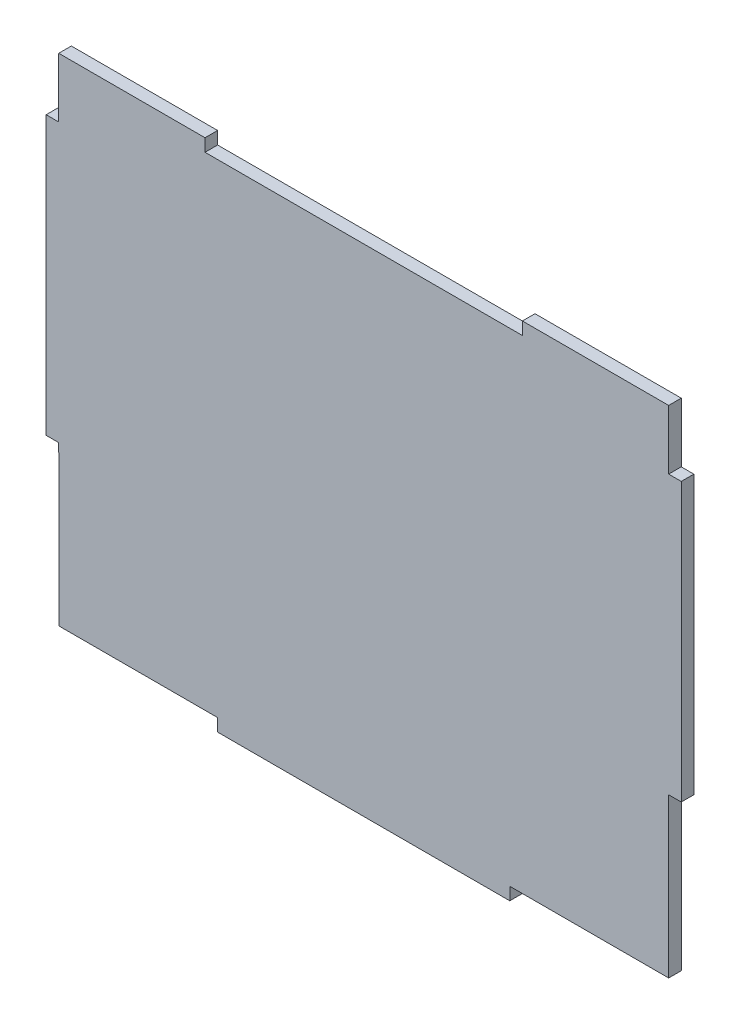
ISO-10303-21;
HEADER;
FILE_DESCRIPTION(('STEP AP214'),'2;1');
FILE_NAME('part.step','',(''),(''),'','','');
FILE_SCHEMA(('AUTOMOTIVE_DESIGN { 1 0 10303 214 1 1 1 1 }'));
ENDSEC;
DATA;
#1=APPLICATION_CONTEXT('core data for automotive mechanical design processes');
#2=APPLICATION_PROTOCOL_DEFINITION('international standard','automotive_design',2000,#1);
#3=PRODUCT_CONTEXT('',#1,'mechanical');
#4=PRODUCT('Part','Part','',(#3));
#5=PRODUCT_RELATED_PRODUCT_CATEGORY('part','',(#4));
#6=PRODUCT_DEFINITION_FORMATION('','',#4);
#7=PRODUCT_DEFINITION_CONTEXT('part definition',#1,'design');
#8=PRODUCT_DEFINITION('design','',#6,#7);
#9=PRODUCT_DEFINITION_SHAPE('','',#8);
#10=(LENGTH_UNIT() NAMED_UNIT(*) SI_UNIT(.MILLI.,.METRE.));
#11=(NAMED_UNIT(*) PLANE_ANGLE_UNIT() SI_UNIT($,.RADIAN.));
#12=(NAMED_UNIT(*) SI_UNIT($,.STERADIAN.) SOLID_ANGLE_UNIT());
#13=UNCERTAINTY_MEASURE_WITH_UNIT(LENGTH_MEASURE(1.E-05),#10,'distance_accuracy_value','');
#14=(GEOMETRIC_REPRESENTATION_CONTEXT(3) GLOBAL_UNCERTAINTY_ASSIGNED_CONTEXT((#13)) GLOBAL_UNIT_ASSIGNED_CONTEXT((#10,
#11,#12)) REPRESENTATION_CONTEXT('',''));
#15=CARTESIAN_POINT('',(0.,0.,0.));
#16=DIRECTION('',(0.,0.,1.));
#17=DIRECTION('',(1.,0.,0.));
#18=AXIS2_PLACEMENT_3D('',#15,#16,#17);
#19=CARTESIAN_POINT('',(-76.875,0.,3.175));
#20=DIRECTION('',(0.,-1.,0.));
#21=DIRECTION('',(0.,0.,-1.));
#22=AXIS2_PLACEMENT_3D('',#19,#20,#21);
#23=PLANE('',#22);
#24=DIRECTION('',(-1.,0.,0.));
#25=VECTOR('',#24,1.);
#26=CARTESIAN_POINT('',(-76.875,0.,0.));
#27=LINE('',#26,#25);
#28=CARTESIAN_POINT('',(76.875,0.,0.));
#29=VERTEX_POINT('',#28);
#30=CARTESIAN_POINT('',(40.,0.,0.));
#31=VERTEX_POINT('',#30);
#32=EDGE_CURVE('E210',#29,#31,#27,.T.);
#33=ORIENTED_EDGE('',*,*,#32,.T.);
#34=DIRECTION('',(0.,0.,1.));
#35=VECTOR('',#34,1.);
#36=CARTESIAN_POINT('',(40.,0.,0.));
#37=LINE('',#36,#35);
#38=CARTESIAN_POINT('',(40.,0.,3.175));
#39=VERTEX_POINT('',#38);
#40=EDGE_CURVE('E195',#31,#39,#37,.T.);
#41=ORIENTED_EDGE('',*,*,#40,.T.);
#42=DIRECTION('',(-1.,0.,0.));
#43=VECTOR('',#42,1.);
#44=CARTESIAN_POINT('',(-76.875,0.,3.175));
#45=LINE('',#44,#43);
#46=CARTESIAN_POINT('',(76.875,0.,3.175));
#47=VERTEX_POINT('',#46);
#48=EDGE_CURVE('E293',#47,#39,#45,.T.);
#49=ORIENTED_EDGE('',*,*,#48,.F.);
#50=DIRECTION('',(0.,0.,-1.));
#51=VECTOR('',#50,1.);
#52=CARTESIAN_POINT('',(76.875,0.,3.175));
#53=LINE('',#52,#51);
#54=EDGE_CURVE('E241',#47,#29,#53,.T.);
#55=ORIENTED_EDGE('',*,*,#54,.T.);
#56=EDGE_LOOP('',(#33,#41,#49,#55));
#57=FACE_BOUND('',#56,.T.);
#58=ADVANCED_FACE('F33',(#57),#23,.F.);
#59=CARTESIAN_POINT('',(-36.825,-128.174968749988,3.175));
#60=DIRECTION('',(0.,1.,0.));
#61=DIRECTION('',(0.,0.,1.));
#62=AXIS2_PLACEMENT_3D('',#59,#60,#61);
#63=PLANE('',#62);
#64=DIRECTION('',(1.,0.,0.));
#65=VECTOR('',#64,1.);
#66=CARTESIAN_POINT('',(-36.825,-128.174968749988,0.));
#67=LINE('',#66,#65);
#68=CARTESIAN_POINT('',(-36.825,-128.174968749988,0.));
#69=VERTEX_POINT('',#68);
#70=CARTESIAN_POINT('',(36.8250000000001,-128.174968749988,0.));
#71=VERTEX_POINT('',#70);
#72=EDGE_CURVE('E191',#69,#71,#67,.T.);
#73=ORIENTED_EDGE('',*,*,#72,.T.);
#74=DIRECTION('',(0.,0.,-1.));
#75=VECTOR('',#74,1.);
#76=CARTESIAN_POINT('',(36.8250000000001,-128.174968749988,3.175));
#77=LINE('',#76,#75);
#78=CARTESIAN_POINT('',(36.8250000000001,-128.174968749988,3.175));
#79=VERTEX_POINT('',#78);
#80=EDGE_CURVE('E11',#79,#71,#77,.T.);
#81=ORIENTED_EDGE('',*,*,#80,.F.);
#82=DIRECTION('',(1.,0.,0.));
#83=VECTOR('',#82,1.);
#84=CARTESIAN_POINT('',(-36.825,-128.174968749988,3.175));
#85=LINE('',#84,#83);
#86=CARTESIAN_POINT('',(-36.825,-128.174968749988,3.175));
#87=VERTEX_POINT('',#86);
#88=EDGE_CURVE('E225',#87,#79,#85,.T.);
#89=ORIENTED_EDGE('',*,*,#88,.F.);
#90=DIRECTION('',(0.,0.,-1.));
#91=VECTOR('',#90,1.);
#92=CARTESIAN_POINT('',(-36.825,-128.174968749988,3.175));
#93=LINE('',#92,#91);
#94=EDGE_CURVE('E187',#87,#69,#93,.T.);
#95=ORIENTED_EDGE('',*,*,#94,.T.);
#96=EDGE_LOOP('',(#73,#81,#89,#95));
#97=FACE_BOUND('',#96,.T.);
#98=ADVANCED_FACE('F35',(#97),#63,.F.);
#99=CARTESIAN_POINT('',(36.8250000000001,-128.174968749988,3.175));
#100=DIRECTION('',(-1.,0.,0.));
#101=DIRECTION('',(0.,-1.,0.));
#102=AXIS2_PLACEMENT_3D('',#99,#100,#101);
#103=PLANE('',#102);
#104=DIRECTION('',(0.,1.,0.));
#105=VECTOR('',#104,1.);
#106=CARTESIAN_POINT('',(36.8250000000001,-128.174968749988,0.));
#107=LINE('',#106,#105);
#108=CARTESIAN_POINT('',(36.8250000000001,-124.999968749988,0.));
#109=VERTEX_POINT('',#108);
#110=EDGE_CURVE('E194',#71,#109,#107,.T.);
#111=ORIENTED_EDGE('',*,*,#110,.T.);
#112=DIRECTION('',(0.,0.,-1.));
#113=VECTOR('',#112,1.);
#114=CARTESIAN_POINT('',(36.8250000000001,-124.999968749988,3.175));
#115=LINE('',#114,#113);
#116=CARTESIAN_POINT('',(36.8250000000001,-124.999968749988,3.175));
#117=VERTEX_POINT('',#116);
#118=EDGE_CURVE('E41',#117,#109,#115,.T.);
#119=ORIENTED_EDGE('',*,*,#118,.F.);
#120=DIRECTION('',(0.,1.,0.));
#121=VECTOR('',#120,1.);
#122=CARTESIAN_POINT('',(36.8250000000001,-128.174968749988,3.175));
#123=LINE('',#122,#121);
#124=EDGE_CURVE('E122',#79,#117,#123,.T.);
#125=ORIENTED_EDGE('',*,*,#124,.F.);
#126=ORIENTED_EDGE('',*,*,#80,.T.);
#127=EDGE_LOOP('',(#111,#119,#125,#126));
#128=FACE_BOUND('',#127,.T.);
#129=ADVANCED_FACE('F401',(#128),#103,.F.);
#130=CARTESIAN_POINT('',(36.8250000000001,-124.999968749988,3.175));
#131=DIRECTION('',(0.,1.,0.));
#132=DIRECTION('',(-1.,0.,0.));
#133=AXIS2_PLACEMENT_3D('',#130,#131,#132);
#134=PLANE('',#133);
#135=DIRECTION('',(1.,0.,0.));
#136=VECTOR('',#135,1.);
#137=CARTESIAN_POINT('',(36.8250000000001,-124.999968749988,0.));
#138=LINE('',#137,#136);
#139=CARTESIAN_POINT('',(76.875,-124.999968749988,0.));
#140=VERTEX_POINT('',#139);
#141=EDGE_CURVE('E197',#109,#140,#138,.T.);
#142=ORIENTED_EDGE('',*,*,#141,.T.);
#143=DIRECTION('',(0.,0.,-1.));
#144=VECTOR('',#143,1.);
#145=CARTESIAN_POINT('',(76.875,-124.999968749988,3.175));
#146=LINE('',#145,#144);
#147=CARTESIAN_POINT('',(76.875,-124.999968749988,3.175));
#148=VERTEX_POINT('',#147);
#149=EDGE_CURVE('E256',#148,#140,#146,.T.);
#150=ORIENTED_EDGE('',*,*,#149,.F.);
#151=DIRECTION('',(1.,0.,0.));
#152=VECTOR('',#151,1.);
#153=CARTESIAN_POINT('',(36.8250000000001,-124.999968749988,3.175));
#154=LINE('',#153,#152);
#155=EDGE_CURVE('E264',#117,#148,#154,.T.);
#156=ORIENTED_EDGE('',*,*,#155,.F.);
#157=ORIENTED_EDGE('',*,*,#118,.T.);
#158=EDGE_LOOP('',(#142,#150,#156,#157));
#159=FACE_BOUND('',#158,.T.);
#160=ADVANCED_FACE('F262',(#159),#134,.F.);
#161=CARTESIAN_POINT('',(76.875,-85.,3.175));
#162=DIRECTION('',(-1.,0.,0.));
#163=DIRECTION('',(0.,-1.,0.));
#164=AXIS2_PLACEMENT_3D('',#161,#162,#163);
#165=PLANE('',#164);
#166=DIRECTION('',(0.,1.,0.));
#167=VECTOR('',#166,1.);
#168=CARTESIAN_POINT('',(76.875,-85.,0.));
#169=LINE('',#168,#167);
#170=CARTESIAN_POINT('',(76.875,-85.,0.));
#171=VERTEX_POINT('',#170);
#172=EDGE_CURVE('E199',#140,#171,#169,.T.);
#173=ORIENTED_EDGE('',*,*,#172,.T.);
#174=DIRECTION('',(0.,0.,-1.));
#175=VECTOR('',#174,1.);
#176=CARTESIAN_POINT('',(76.875,-85.,3.175));
#177=LINE('',#176,#175);
#178=CARTESIAN_POINT('',(76.875,-85.,3.175));
#179=VERTEX_POINT('',#178);
#180=EDGE_CURVE('E253',#179,#171,#177,.T.);
#181=ORIENTED_EDGE('',*,*,#180,.F.);
#182=DIRECTION('',(0.,1.,0.));
#183=VECTOR('',#182,1.);
#184=CARTESIAN_POINT('',(76.875,-85.,3.175));
#185=LINE('',#184,#183);
#186=EDGE_CURVE('E282',#148,#179,#185,.T.);
#187=ORIENTED_EDGE('',*,*,#186,.F.);
#188=ORIENTED_EDGE('',*,*,#149,.T.);
#189=EDGE_LOOP('',(#173,#181,#187,#188));
#190=FACE_BOUND('',#189,.T.);
#191=ADVANCED_FACE('F273',(#190),#165,.F.);
#192=CARTESIAN_POINT('',(80.05,-85.,3.175));
#193=DIRECTION('',(0.,1.,0.));
#194=DIRECTION('',(-1.,0.,0.));
#195=AXIS2_PLACEMENT_3D('',#192,#193,#194);
#196=PLANE('',#195);
#197=DIRECTION('',(1.,0.,0.));
#198=VECTOR('',#197,1.);
#199=CARTESIAN_POINT('',(80.05,-85.,0.));
#200=LINE('',#199,#198);
#201=CARTESIAN_POINT('',(80.05,-85.,0.));
#202=VERTEX_POINT('',#201);
#203=EDGE_CURVE('E201',#171,#202,#200,.T.);
#204=ORIENTED_EDGE('',*,*,#203,.T.);
#205=DIRECTION('',(0.,0.,-1.));
#206=VECTOR('',#205,1.);
#207=CARTESIAN_POINT('',(80.05,-85.,3.175));
#208=LINE('',#207,#206);
#209=CARTESIAN_POINT('',(80.05,-85.,3.175));
#210=VERTEX_POINT('',#209);
#211=EDGE_CURVE('E250',#210,#202,#208,.T.);
#212=ORIENTED_EDGE('',*,*,#211,.F.);
#213=DIRECTION('',(1.,0.,0.));
#214=VECTOR('',#213,1.);
#215=CARTESIAN_POINT('',(80.05,-85.,3.175));
#216=LINE('',#215,#214);
#217=EDGE_CURVE('E279',#179,#210,#216,.T.);
#218=ORIENTED_EDGE('',*,*,#217,.F.);
#219=ORIENTED_EDGE('',*,*,#180,.T.);
#220=EDGE_LOOP('',(#204,#212,#218,#219));
#221=FACE_BOUND('',#220,.T.);
#222=ADVANCED_FACE('F277',(#221),#196,.F.);
#223=CARTESIAN_POINT('',(80.05,-15.,3.175));
#224=DIRECTION('',(-1.,0.,0.));
#225=DIRECTION('',(0.,-1.,0.));
#226=AXIS2_PLACEMENT_3D('',#223,#224,#225);
#227=PLANE('',#226);
#228=DIRECTION('',(0.,1.,0.));
#229=VECTOR('',#228,1.);
#230=CARTESIAN_POINT('',(80.05,-15.,0.));
#231=LINE('',#230,#229);
#232=CARTESIAN_POINT('',(80.05,-15.,0.));
#233=VERTEX_POINT('',#232);
#234=EDGE_CURVE('E203',#202,#233,#231,.T.);
#235=ORIENTED_EDGE('',*,*,#234,.T.);
#236=DIRECTION('',(0.,0.,-1.));
#237=VECTOR('',#236,1.);
#238=CARTESIAN_POINT('',(80.05,-15.,3.175));
#239=LINE('',#238,#237);
#240=CARTESIAN_POINT('',(80.05,-15.,3.175));
#241=VERTEX_POINT('',#240);
#242=EDGE_CURVE('E247',#241,#233,#239,.T.);
#243=ORIENTED_EDGE('',*,*,#242,.F.);
#244=DIRECTION('',(0.,1.,0.));
#245=VECTOR('',#244,1.);
#246=CARTESIAN_POINT('',(80.05,-15.,3.175));
#247=LINE('',#246,#245);
#248=EDGE_CURVE('E281',#210,#241,#247,.T.);
#249=ORIENTED_EDGE('',*,*,#248,.F.);
#250=ORIENTED_EDGE('',*,*,#211,.T.);
#251=EDGE_LOOP('',(#235,#243,#249,#250));
#252=FACE_BOUND('',#251,.T.);
#253=ADVANCED_FACE('F387',(#252),#227,.F.);
#254=CARTESIAN_POINT('',(76.875,-15.,3.175));
#255=DIRECTION('',(0.,-1.,0.));
#256=DIRECTION('',(0.,0.,-1.));
#257=AXIS2_PLACEMENT_3D('',#254,#255,#256);
#258=PLANE('',#257);
#259=DIRECTION('',(-1.,0.,0.));
#260=VECTOR('',#259,1.);
#261=CARTESIAN_POINT('',(76.875,-15.,0.));
#262=LINE('',#261,#260);
#263=CARTESIAN_POINT('',(76.875,-15.,0.));
#264=VERTEX_POINT('',#263);
#265=EDGE_CURVE('E205',#233,#264,#262,.T.);
#266=ORIENTED_EDGE('',*,*,#265,.T.);
#267=DIRECTION('',(0.,0.,-1.));
#268=VECTOR('',#267,1.);
#269=CARTESIAN_POINT('',(76.875,-15.,3.175));
#270=LINE('',#269,#268);
#271=CARTESIAN_POINT('',(76.875,-15.,3.175));
#272=VERTEX_POINT('',#271);
#273=EDGE_CURVE('E244',#272,#264,#270,.T.);
#274=ORIENTED_EDGE('',*,*,#273,.F.);
#275=DIRECTION('',(-1.,0.,0.));
#276=VECTOR('',#275,1.);
#277=CARTESIAN_POINT('',(76.875,-15.,3.175));
#278=LINE('',#277,#276);
#279=EDGE_CURVE('E284',#241,#272,#278,.T.);
#280=ORIENTED_EDGE('',*,*,#279,.F.);
#281=ORIENTED_EDGE('',*,*,#242,.T.);
#282=EDGE_LOOP('',(#266,#274,#280,#281));
#283=FACE_BOUND('',#282,.T.);
#284=ADVANCED_FACE('F383',(#283),#258,.F.);
#285=CARTESIAN_POINT('',(76.875,0.,3.175));
#286=DIRECTION('',(-1.,0.,0.));
#287=DIRECTION('',(0.,0.,1.));
#288=AXIS2_PLACEMENT_3D('',#285,#286,#287);
#289=PLANE('',#288);
#290=DIRECTION('',(0.,1.,0.));
#291=VECTOR('',#290,1.);
#292=CARTESIAN_POINT('',(76.875,0.,0.));
#293=LINE('',#292,#291);
#294=EDGE_CURVE('E207',#264,#29,#293,.T.);
#295=ORIENTED_EDGE('',*,*,#294,.T.);
#296=ORIENTED_EDGE('',*,*,#54,.F.);
#297=DIRECTION('',(0.,1.,0.));
#298=VECTOR('',#297,1.);
#299=CARTESIAN_POINT('',(76.875,0.,3.175));
#300=LINE('',#299,#298);
#301=EDGE_CURVE('E290',#272,#47,#300,.T.);
#302=ORIENTED_EDGE('',*,*,#301,.F.);
#303=ORIENTED_EDGE('',*,*,#273,.T.);
#304=EDGE_LOOP('',(#295,#296,#302,#303));
#305=FACE_BOUND('',#304,.T.);
#306=ADVANCED_FACE('F379',(#305),#289,.F.);
#307=CARTESIAN_POINT('',(-40.,0.,3.175));
#308=VERTEX_POINT('',#307);
#309=CARTESIAN_POINT('',(-76.875,0.,3.175));
#310=VERTEX_POINT('',#309);
#311=EDGE_CURVE('E292',#308,#310,#45,.T.);
#312=ORIENTED_EDGE('',*,*,#311,.F.);
#313=DIRECTION('',(0.,0.,1.));
#314=VECTOR('',#313,1.);
#315=CARTESIAN_POINT('',(-40.,0.,0.));
#316=LINE('',#315,#314);
#317=CARTESIAN_POINT('',(-40.,0.,0.));
#318=VERTEX_POINT('',#317);
#319=EDGE_CURVE('E318',#318,#308,#316,.T.);
#320=ORIENTED_EDGE('',*,*,#319,.F.);
#321=CARTESIAN_POINT('',(-76.875,0.,0.));
#322=VERTEX_POINT('',#321);
#323=EDGE_CURVE('E209',#318,#322,#27,.T.);
#324=ORIENTED_EDGE('',*,*,#323,.T.);
#325=DIRECTION('',(0.,0.,-1.));
#326=VECTOR('',#325,1.);
#327=CARTESIAN_POINT('',(-76.875,0.,3.175));
#328=LINE('',#327,#326);
#329=EDGE_CURVE('E238',#310,#322,#328,.T.);
#330=ORIENTED_EDGE('',*,*,#329,.F.);
#331=EDGE_LOOP('',(#312,#320,#324,#330));
#332=FACE_BOUND('',#331,.T.);
#333=ADVANCED_FACE('F356',(#332),#23,.F.);
#334=CARTESIAN_POINT('',(-76.875,0.,3.175));
#335=DIRECTION('',(1.,0.,0.));
#336=DIRECTION('',(0.,0.,-1.));
#337=AXIS2_PLACEMENT_3D('',#334,#335,#336);
#338=PLANE('',#337);
#339=DIRECTION('',(0.,-1.,0.));
#340=VECTOR('',#339,1.);
#341=CARTESIAN_POINT('',(-76.875,0.,0.));
#342=LINE('',#341,#340);
#343=CARTESIAN_POINT('',(-76.875,-15.,0.));
#344=VERTEX_POINT('',#343);
#345=EDGE_CURVE('E213',#322,#344,#342,.T.);
#346=ORIENTED_EDGE('',*,*,#345,.T.);
#347=DIRECTION('',(0.,0.,-1.));
#348=VECTOR('',#347,1.);
#349=CARTESIAN_POINT('',(-76.875,-15.,3.175));
#350=LINE('',#349,#348);
#351=CARTESIAN_POINT('',(-76.875,-15.,3.175));
#352=VERTEX_POINT('',#351);
#353=EDGE_CURVE('E235',#352,#344,#350,.T.);
#354=ORIENTED_EDGE('',*,*,#353,.F.);
#355=DIRECTION('',(0.,-1.,0.));
#356=VECTOR('',#355,1.);
#357=CARTESIAN_POINT('',(-76.875,0.,3.175));
#358=LINE('',#357,#356);
#359=EDGE_CURVE('E296',#310,#352,#358,.T.);
#360=ORIENTED_EDGE('',*,*,#359,.F.);
#361=ORIENTED_EDGE('',*,*,#329,.T.);
#362=EDGE_LOOP('',(#346,#354,#360,#361));
#363=FACE_BOUND('',#362,.T.);
#364=ADVANCED_FACE('F405',(#363),#338,.F.);
#365=CARTESIAN_POINT('',(-76.875,-15.,3.175));
#366=DIRECTION('',(0.,-1.,0.));
#367=DIRECTION('',(1.,0.,0.));
#368=AXIS2_PLACEMENT_3D('',#365,#366,#367);
#369=PLANE('',#368);
#370=DIRECTION('',(-1.,0.,0.));
#371=VECTOR('',#370,1.);
#372=CARTESIAN_POINT('',(-76.875,-15.,0.));
#373=LINE('',#372,#371);
#374=CARTESIAN_POINT('',(-80.05,-15.,0.));
#375=VERTEX_POINT('',#374);
#376=EDGE_CURVE('E215',#344,#375,#373,.T.);
#377=ORIENTED_EDGE('',*,*,#376,.T.);
#378=DIRECTION('',(0.,0.,-1.));
#379=VECTOR('',#378,1.);
#380=CARTESIAN_POINT('',(-80.05,-15.,3.175));
#381=LINE('',#380,#379);
#382=CARTESIAN_POINT('',(-80.05,-15.,3.175));
#383=VERTEX_POINT('',#382);
#384=EDGE_CURVE('E232',#383,#375,#381,.T.);
#385=ORIENTED_EDGE('',*,*,#384,.F.);
#386=DIRECTION('',(-1.,0.,0.));
#387=VECTOR('',#386,1.);
#388=CARTESIAN_POINT('',(-76.875,-15.,3.175));
#389=LINE('',#388,#387);
#390=EDGE_CURVE('E298',#352,#383,#389,.T.);
#391=ORIENTED_EDGE('',*,*,#390,.F.);
#392=ORIENTED_EDGE('',*,*,#353,.T.);
#393=EDGE_LOOP('',(#377,#385,#391,#392));
#394=FACE_BOUND('',#393,.T.);
#395=ADVANCED_FACE('F410',(#394),#369,.F.);
#396=CARTESIAN_POINT('',(-80.05,-15.,3.175));
#397=DIRECTION('',(1.,0.,0.));
#398=DIRECTION('',(0.,1.,0.));
#399=AXIS2_PLACEMENT_3D('',#396,#397,#398);
#400=PLANE('',#399);
#401=DIRECTION('',(0.,-1.,0.));
#402=VECTOR('',#401,1.);
#403=CARTESIAN_POINT('',(-80.05,-15.,0.));
#404=LINE('',#403,#402);
#405=CARTESIAN_POINT('',(-80.05,-85.,0.));
#406=VERTEX_POINT('',#405);
#407=EDGE_CURVE('E217',#375,#406,#404,.T.);
#408=ORIENTED_EDGE('',*,*,#407,.T.);
#409=DIRECTION('',(0.,0.,-1.));
#410=VECTOR('',#409,1.);
#411=CARTESIAN_POINT('',(-80.05,-85.,3.175));
#412=LINE('',#411,#410);
#413=CARTESIAN_POINT('',(-80.05,-85.,3.175));
#414=VERTEX_POINT('',#413);
#415=EDGE_CURVE('E229',#414,#406,#412,.T.);
#416=ORIENTED_EDGE('',*,*,#415,.F.);
#417=DIRECTION('',(0.,-1.,0.));
#418=VECTOR('',#417,1.);
#419=CARTESIAN_POINT('',(-80.05,-15.,3.175));
#420=LINE('',#419,#418);
#421=EDGE_CURVE('E300',#383,#414,#420,.T.);
#422=ORIENTED_EDGE('',*,*,#421,.F.);
#423=ORIENTED_EDGE('',*,*,#384,.T.);
#424=EDGE_LOOP('',(#408,#416,#422,#423));
#425=FACE_BOUND('',#424,.T.);
#426=ADVANCED_FACE('F306',(#425),#400,.F.);
#427=CARTESIAN_POINT('',(-80.05,-85.,3.175));
#428=DIRECTION('',(0.,1.,0.));
#429=DIRECTION('',(-1.,0.,0.));
#430=AXIS2_PLACEMENT_3D('',#427,#428,#429);
#431=PLANE('',#430);
#432=DIRECTION('',(1.,0.,0.));
#433=VECTOR('',#432,1.);
#434=CARTESIAN_POINT('',(-80.05,-85.,0.));
#435=LINE('',#434,#433);
#436=CARTESIAN_POINT('',(-76.875,-85.,0.));
#437=VERTEX_POINT('',#436);
#438=EDGE_CURVE('E219',#406,#437,#435,.T.);
#439=ORIENTED_EDGE('',*,*,#438,.T.);
#440=DIRECTION('',(0.,0.,-1.));
#441=VECTOR('',#440,1.);
#442=CARTESIAN_POINT('',(-76.875,-85.,3.175));
#443=LINE('',#442,#441);
#444=CARTESIAN_POINT('',(-76.875,-85.,3.175));
#445=VERTEX_POINT('',#444);
#446=EDGE_CURVE('E182',#445,#437,#443,.T.);
#447=ORIENTED_EDGE('',*,*,#446,.F.);
#448=DIRECTION('',(1.,0.,0.));
#449=VECTOR('',#448,1.);
#450=CARTESIAN_POINT('',(-80.05,-85.,3.175));
#451=LINE('',#450,#449);
#452=EDGE_CURVE('E170',#414,#445,#451,.T.);
#453=ORIENTED_EDGE('',*,*,#452,.F.);
#454=ORIENTED_EDGE('',*,*,#415,.T.);
#455=EDGE_LOOP('',(#439,#447,#453,#454));
#456=FACE_BOUND('',#455,.T.);
#457=ADVANCED_FACE('F310',(#456),#431,.F.);
#458=CARTESIAN_POINT('',(-76.875,-85.,3.175));
#459=DIRECTION('',(0.999999218749695,0.00124999999999848,0.));
#460=DIRECTION('',(-0.00124999999999848,0.999999218749695,0.));
#461=AXIS2_PLACEMENT_3D('',#458,#459,#460);
#462=PLANE('',#461);
#463=DIRECTION('',(0.00124999999999847,-0.999999218749695,0.));
#464=VECTOR('',#463,1.);
#465=CARTESIAN_POINT('',(-76.875,-85.,0.));
#466=LINE('',#465,#464);
#467=CARTESIAN_POINT('',(-76.825,-124.999968749988,0.));
#468=VERTEX_POINT('',#467);
#469=EDGE_CURVE('E179',#437,#468,#466,.T.);
#470=ORIENTED_EDGE('',*,*,#469,.T.);
#471=DIRECTION('',(0.,0.,-1.));
#472=VECTOR('',#471,1.);
#473=CARTESIAN_POINT('',(-76.825,-124.999968749988,3.175));
#474=LINE('',#473,#472);
#475=CARTESIAN_POINT('',(-76.825,-124.999968749988,3.175));
#476=VERTEX_POINT('',#475);
#477=EDGE_CURVE('E176',#476,#468,#474,.T.);
#478=ORIENTED_EDGE('',*,*,#477,.F.);
#479=DIRECTION('',(0.00124999999999847,-0.999999218749695,0.));
#480=VECTOR('',#479,1.);
#481=CARTESIAN_POINT('',(-76.875,-85.,3.175));
#482=LINE('',#481,#480);
#483=EDGE_CURVE('E162',#445,#476,#482,.T.);
#484=ORIENTED_EDGE('',*,*,#483,.F.);
#485=ORIENTED_EDGE('',*,*,#446,.T.);
#486=EDGE_LOOP('',(#470,#478,#484,#485));
#487=FACE_BOUND('',#486,.T.);
#488=ADVANCED_FACE('F177',(#487),#462,.F.);
#489=CARTESIAN_POINT('',(-76.825,-124.999968749988,3.175));
#490=DIRECTION('',(0.,1.,0.));
#491=DIRECTION('',(0.,0.,1.));
#492=AXIS2_PLACEMENT_3D('',#489,#490,#491);
#493=PLANE('',#492);
#494=DIRECTION('',(1.,0.,0.));
#495=VECTOR('',#494,1.);
#496=CARTESIAN_POINT('',(-76.825,-124.999968749988,0.));
#497=LINE('',#496,#495);
#498=CARTESIAN_POINT('',(-36.825,-124.999968749988,0.));
#499=VERTEX_POINT('',#498);
#500=EDGE_CURVE('E222',#468,#499,#497,.T.);
#501=ORIENTED_EDGE('',*,*,#500,.T.);
#502=DIRECTION('',(0.,0.,-1.));
#503=VECTOR('',#502,1.);
#504=CARTESIAN_POINT('',(-36.825,-124.999968749988,3.175));
#505=LINE('',#504,#503);
#506=CARTESIAN_POINT('',(-36.825,-124.999968749988,3.175));
#507=VERTEX_POINT('',#506);
#508=EDGE_CURVE('E183',#507,#499,#505,.T.);
#509=ORIENTED_EDGE('',*,*,#508,.F.);
#510=DIRECTION('',(1.,0.,0.));
#511=VECTOR('',#510,1.);
#512=CARTESIAN_POINT('',(-76.825,-124.999968749988,3.175));
#513=LINE('',#512,#511);
#514=EDGE_CURVE('E167',#476,#507,#513,.T.);
#515=ORIENTED_EDGE('',*,*,#514,.F.);
#516=ORIENTED_EDGE('',*,*,#477,.T.);
#517=EDGE_LOOP('',(#501,#509,#515,#516));
#518=FACE_BOUND('',#517,.T.);
#519=ADVANCED_FACE('F185',(#518),#493,.F.);
#520=CARTESIAN_POINT('',(-36.825,-128.174968749988,3.175));
#521=DIRECTION('',(1.,0.,0.));
#522=DIRECTION('',(0.,1.,0.));
#523=AXIS2_PLACEMENT_3D('',#520,#521,#522);
#524=PLANE('',#523);
#525=DIRECTION('',(0.,-1.,0.));
#526=VECTOR('',#525,1.);
#527=CARTESIAN_POINT('',(-36.825,-128.174968749988,0.));
#528=LINE('',#527,#526);
#529=EDGE_CURVE('E114',#499,#69,#528,.T.);
#530=ORIENTED_EDGE('',*,*,#529,.T.);
#531=ORIENTED_EDGE('',*,*,#94,.F.);
#532=DIRECTION('',(0.,-1.,0.));
#533=VECTOR('',#532,1.);
#534=CARTESIAN_POINT('',(-36.825,-128.174968749988,3.175));
#535=LINE('',#534,#533);
#536=EDGE_CURVE('E57',#507,#87,#535,.T.);
#537=ORIENTED_EDGE('',*,*,#536,.F.);
#538=ORIENTED_EDGE('',*,*,#508,.T.);
#539=EDGE_LOOP('',(#530,#531,#537,#538));
#540=FACE_BOUND('',#539,.T.);
#541=ADVANCED_FACE('F311',(#540),#524,.F.);
#542=CARTESIAN_POINT('',(0.,0.,3.175));
#543=DIRECTION('',(0.,0.,1.));
#544=DIRECTION('',(1.,0.,0.));
#545=AXIS2_PLACEMENT_3D('',#542,#543,#544);
#546=PLANE('',#545);
#547=DIRECTION('',(0.,1.,0.));
#548=VECTOR('',#547,1.);
#549=CARTESIAN_POINT('',(40.,0.,3.175));
#550=LINE('',#549,#548);
#551=CARTESIAN_POINT('',(40.,-3.17499999999999,3.175));
#552=VERTEX_POINT('',#551);
#553=EDGE_CURVE('E329',#552,#39,#550,.T.);
#554=ORIENTED_EDGE('',*,*,#553,.F.);
#555=DIRECTION('',(1.,0.,0.));
#556=VECTOR('',#555,1.);
#557=CARTESIAN_POINT('',(40.,-3.17499999999999,3.175));
#558=LINE('',#557,#556);
#559=CARTESIAN_POINT('',(-40.,-3.17500000000001,3.175));
#560=VERTEX_POINT('',#559);
#561=EDGE_CURVE('E333',#560,#552,#558,.T.);
#562=ORIENTED_EDGE('',*,*,#561,.F.);
#563=DIRECTION('',(0.,-1.,0.));
#564=VECTOR('',#563,1.);
#565=CARTESIAN_POINT('',(-40.,-3.17500000000001,3.175));
#566=LINE('',#565,#564);
#567=EDGE_CURVE('E336',#308,#560,#566,.T.);
#568=ORIENTED_EDGE('',*,*,#567,.F.);
#569=ORIENTED_EDGE('',*,*,#311,.T.);
#570=ORIENTED_EDGE('',*,*,#359,.T.);
#571=ORIENTED_EDGE('',*,*,#390,.T.);
#572=ORIENTED_EDGE('',*,*,#421,.T.);
#573=ORIENTED_EDGE('',*,*,#452,.T.);
#574=ORIENTED_EDGE('',*,*,#483,.T.);
#575=ORIENTED_EDGE('',*,*,#514,.T.);
#576=ORIENTED_EDGE('',*,*,#536,.T.);
#577=ORIENTED_EDGE('',*,*,#88,.T.);
#578=ORIENTED_EDGE('',*,*,#124,.T.);
#579=ORIENTED_EDGE('',*,*,#155,.T.);
#580=ORIENTED_EDGE('',*,*,#186,.T.);
#581=ORIENTED_EDGE('',*,*,#217,.T.);
#582=ORIENTED_EDGE('',*,*,#248,.T.);
#583=ORIENTED_EDGE('',*,*,#279,.T.);
#584=ORIENTED_EDGE('',*,*,#301,.T.);
#585=ORIENTED_EDGE('',*,*,#48,.T.);
#586=EDGE_LOOP('',(#554,#562,#568,#569,#570,#571,#572,#573,#574,#575,#576,#577,#578,#579,#580,
#581,#582,#583,#584,#585));
#587=FACE_BOUND('',#586,.T.);
#588=ADVANCED_FACE('F165',(#587),#546,.T.);
#589=CARTESIAN_POINT('',(0.,0.,0.));
#590=DIRECTION('',(0.,0.,1.));
#591=DIRECTION('',(1.,0.,0.));
#592=AXIS2_PLACEMENT_3D('',#589,#590,#591);
#593=PLANE('',#592);
#594=DIRECTION('',(1.,0.,0.));
#595=VECTOR('',#594,1.);
#596=CARTESIAN_POINT('',(40.,-3.17499999999999,0.));
#597=LINE('',#596,#595);
#598=CARTESIAN_POINT('',(-40.,-3.17500000000001,0.));
#599=VERTEX_POINT('',#598);
#600=CARTESIAN_POINT('',(40.,-3.17499999999999,0.));
#601=VERTEX_POINT('',#600);
#602=EDGE_CURVE('E48',#599,#601,#597,.T.);
#603=ORIENTED_EDGE('',*,*,#602,.T.);
#604=DIRECTION('',(0.,1.,0.));
#605=VECTOR('',#604,1.);
#606=CARTESIAN_POINT('',(40.,0.,0.));
#607=LINE('',#606,#605);
#608=EDGE_CURVE('E322',#601,#31,#607,.T.);
#609=ORIENTED_EDGE('',*,*,#608,.T.);
#610=ORIENTED_EDGE('',*,*,#32,.F.);
#611=ORIENTED_EDGE('',*,*,#294,.F.);
#612=ORIENTED_EDGE('',*,*,#265,.F.);
#613=ORIENTED_EDGE('',*,*,#234,.F.);
#614=ORIENTED_EDGE('',*,*,#203,.F.);
#615=ORIENTED_EDGE('',*,*,#172,.F.);
#616=ORIENTED_EDGE('',*,*,#141,.F.);
#617=ORIENTED_EDGE('',*,*,#110,.F.);
#618=ORIENTED_EDGE('',*,*,#72,.F.);
#619=ORIENTED_EDGE('',*,*,#529,.F.);
#620=ORIENTED_EDGE('',*,*,#500,.F.);
#621=ORIENTED_EDGE('',*,*,#469,.F.);
#622=ORIENTED_EDGE('',*,*,#438,.F.);
#623=ORIENTED_EDGE('',*,*,#407,.F.);
#624=ORIENTED_EDGE('',*,*,#376,.F.);
#625=ORIENTED_EDGE('',*,*,#345,.F.);
#626=ORIENTED_EDGE('',*,*,#323,.F.);
#627=DIRECTION('',(0.,-1.,0.));
#628=VECTOR('',#627,1.);
#629=CARTESIAN_POINT('',(-40.,-3.17500000000001,0.));
#630=LINE('',#629,#628);
#631=EDGE_CURVE('E332',#318,#599,#630,.T.);
#632=ORIENTED_EDGE('',*,*,#631,.T.);
#633=EDGE_LOOP('',(#603,#609,#610,#611,#612,#613,#614,#615,#616,#617,#618,#619,#620,#621,#622,
#623,#624,#625,#626,#632));
#634=FACE_BOUND('',#633,.T.);
#635=ADVANCED_FACE('F267',(#634),#593,.F.);
#636=CARTESIAN_POINT('',(40.,0.,0.));
#637=DIRECTION('',(1.,0.,0.));
#638=DIRECTION('',(0.,0.,-1.));
#639=AXIS2_PLACEMENT_3D('',#636,#637,#638);
#640=PLANE('',#639);
#641=ORIENTED_EDGE('',*,*,#553,.T.);
#642=ORIENTED_EDGE('',*,*,#40,.F.);
#643=ORIENTED_EDGE('',*,*,#608,.F.);
#644=DIRECTION('',(0.,0.,1.));
#645=VECTOR('',#644,1.);
#646=CARTESIAN_POINT('',(40.,-3.17499999999999,0.));
#647=LINE('',#646,#645);
#648=EDGE_CURVE('E324',#601,#552,#647,.T.);
#649=ORIENTED_EDGE('',*,*,#648,.T.);
#650=EDGE_LOOP('',(#641,#642,#643,#649));
#651=FACE_BOUND('',#650,.T.);
#652=ADVANCED_FACE('F371',(#651),#640,.F.);
#653=CARTESIAN_POINT('',(40.,-3.17499999999999,0.));
#654=DIRECTION('',(0.,-1.,0.));
#655=DIRECTION('',(1.,0.,0.));
#656=AXIS2_PLACEMENT_3D('',#653,#654,#655);
#657=PLANE('',#656);
#658=ORIENTED_EDGE('',*,*,#561,.T.);
#659=ORIENTED_EDGE('',*,*,#648,.F.);
#660=ORIENTED_EDGE('',*,*,#602,.F.);
#661=DIRECTION('',(0.,0.,1.));
#662=VECTOR('',#661,1.);
#663=CARTESIAN_POINT('',(-40.,-3.17500000000001,0.));
#664=LINE('',#663,#662);
#665=EDGE_CURVE('E321',#599,#560,#664,.T.);
#666=ORIENTED_EDGE('',*,*,#665,.T.);
#667=EDGE_LOOP('',(#658,#659,#660,#666));
#668=FACE_BOUND('',#667,.T.);
#669=ADVANCED_FACE('F369',(#668),#657,.F.);
#670=CARTESIAN_POINT('',(-40.,-3.17500000000001,0.));
#671=DIRECTION('',(-1.,0.,0.));
#672=DIRECTION('',(0.,-1.,0.));
#673=AXIS2_PLACEMENT_3D('',#670,#671,#672);
#674=PLANE('',#673);
#675=ORIENTED_EDGE('',*,*,#567,.T.);
#676=ORIENTED_EDGE('',*,*,#665,.F.);
#677=ORIENTED_EDGE('',*,*,#631,.F.);
#678=ORIENTED_EDGE('',*,*,#319,.T.);
#679=EDGE_LOOP('',(#675,#676,#677,#678));
#680=FACE_BOUND('',#679,.T.);
#681=ADVANCED_FACE('F350',(#680),#674,.F.);
#682=CLOSED_SHELL('',(#58,#98,#129,#160,#191,#222,#253,#284,#306,#333,#364,#395,#426,#457,#488,
#519,#541,#588,#635,#652,#669,#681));
#683=MANIFOLD_SOLID_BREP('B2',#682);
#684=ADVANCED_BREP_SHAPE_REPRESENTATION('',(#18,#683),#14);
#685=SHAPE_DEFINITION_REPRESENTATION(#9,#684);
ENDSEC;
END-ISO-10303-21;
